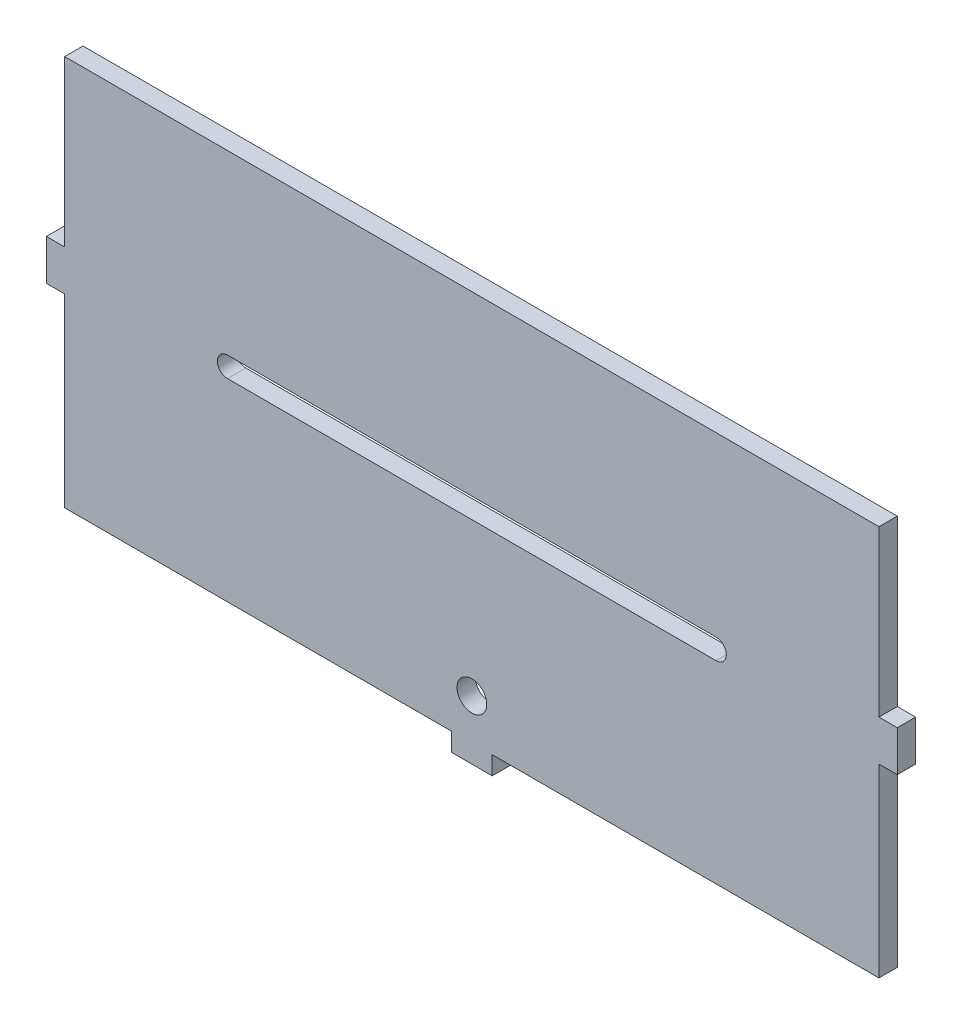
ISO-10303-21;
HEADER;
FILE_DESCRIPTION(('STEP AP214'),'2;1');
FILE_NAME('part.step','',(''),(''),'','','');
FILE_SCHEMA(('AUTOMOTIVE_DESIGN { 1 0 10303 214 1 1 1 1 }'));
ENDSEC;
DATA;
#1=APPLICATION_CONTEXT('core data for automotive mechanical design processes');
#2=APPLICATION_PROTOCOL_DEFINITION('international standard','automotive_design',2000,#1);
#3=PRODUCT_CONTEXT('',#1,'mechanical');
#4=PRODUCT('Part','Part','',(#3));
#5=PRODUCT_RELATED_PRODUCT_CATEGORY('part','',(#4));
#6=PRODUCT_DEFINITION_FORMATION('','',#4);
#7=PRODUCT_DEFINITION_CONTEXT('part definition',#1,'design');
#8=PRODUCT_DEFINITION('design','',#6,#7);
#9=PRODUCT_DEFINITION_SHAPE('','',#8);
#10=(LENGTH_UNIT() NAMED_UNIT(*) SI_UNIT(.MILLI.,.METRE.));
#11=(NAMED_UNIT(*) PLANE_ANGLE_UNIT() SI_UNIT($,.RADIAN.));
#12=(NAMED_UNIT(*) SI_UNIT($,.STERADIAN.) SOLID_ANGLE_UNIT());
#13=UNCERTAINTY_MEASURE_WITH_UNIT(LENGTH_MEASURE(1.E-05),#10,'distance_accuracy_value','');
#14=(GEOMETRIC_REPRESENTATION_CONTEXT(3) GLOBAL_UNCERTAINTY_ASSIGNED_CONTEXT((#13)) GLOBAL_UNIT_ASSIGNED_CONTEXT((#10,
#11,#12)) REPRESENTATION_CONTEXT('',''));
#15=CARTESIAN_POINT('',(0.,0.,0.));
#16=DIRECTION('',(0.,0.,1.));
#17=DIRECTION('',(1.,0.,0.));
#18=AXIS2_PLACEMENT_3D('',#15,#16,#17);
#19=CARTESIAN_POINT('',(127.,6.98499999999998,5.715));
#20=DIRECTION('',(-1.,0.,0.));
#21=DIRECTION('',(0.,0.,1.));
#22=AXIS2_PLACEMENT_3D('',#19,#20,#21);
#23=PLANE('',#22);
#24=DIRECTION('',(0.,1.,0.));
#25=VECTOR('',#24,1.);
#26=CARTESIAN_POINT('',(127.,6.98499999999998,0.));
#27=LINE('',#26,#25);
#28=CARTESIAN_POINT('',(127.,6.98499999999998,0.));
#29=VERTEX_POINT('',#28);
#30=CARTESIAN_POINT('',(127.,58.42,0.));
#31=VERTEX_POINT('',#30);
#32=EDGE_CURVE('E205',#29,#31,#27,.T.);
#33=ORIENTED_EDGE('',*,*,#32,.T.);
#34=DIRECTION('',(0.,0.,1.));
#35=VECTOR('',#34,1.);
#36=CARTESIAN_POINT('',(127.,58.42,0.));
#37=LINE('',#36,#35);
#38=CARTESIAN_POINT('',(127.,58.42,5.715));
#39=VERTEX_POINT('',#38);
#40=EDGE_CURVE('E60',#31,#39,#37,.T.);
#41=ORIENTED_EDGE('',*,*,#40,.T.);
#42=DIRECTION('',(0.,1.,0.));
#43=VECTOR('',#42,1.);
#44=CARTESIAN_POINT('',(127.,6.98499999999998,5.715));
#45=LINE('',#44,#43);
#46=CARTESIAN_POINT('',(127.,6.98499999999998,5.715));
#47=VERTEX_POINT('',#46);
#48=EDGE_CURVE('E252',#47,#39,#45,.T.);
#49=ORIENTED_EDGE('',*,*,#48,.F.);
#50=DIRECTION('',(0.,0.,-1.));
#51=VECTOR('',#50,1.);
#52=CARTESIAN_POINT('',(127.,6.98499999999998,5.715));
#53=LINE('',#52,#51);
#54=EDGE_CURVE('E253',#47,#29,#53,.T.);
#55=ORIENTED_EDGE('',*,*,#54,.T.);
#56=EDGE_LOOP('',(#33,#41,#49,#55));
#57=FACE_BOUND('',#56,.T.);
#58=ADVANCED_FACE('F45',(#57),#23,.F.);
#59=CARTESIAN_POINT('',(-127.,6.98499999999998,5.715));
#60=DIRECTION('',(1.,0.,0.));
#61=DIRECTION('',(0.,0.,-1.));
#62=AXIS2_PLACEMENT_3D('',#59,#60,#61);
#63=PLANE('',#62);
#64=DIRECTION('',(0.,-1.,0.));
#65=VECTOR('',#64,1.);
#66=CARTESIAN_POINT('',(-127.,6.98499999999998,5.715));
#67=LINE('',#66,#65);
#68=CARTESIAN_POINT('',(-127.,58.42,5.715));
#69=VERTEX_POINT('',#68);
#70=CARTESIAN_POINT('',(-127.,6.98499999999998,5.715));
#71=VERTEX_POINT('',#70);
#72=EDGE_CURVE('E196',#69,#71,#67,.T.);
#73=ORIENTED_EDGE('',*,*,#72,.F.);
#74=DIRECTION('',(0.,0.,1.));
#75=VECTOR('',#74,1.);
#76=CARTESIAN_POINT('',(-127.,58.42,0.));
#77=LINE('',#76,#75);
#78=CARTESIAN_POINT('',(-127.,58.42,0.));
#79=VERTEX_POINT('',#78);
#80=EDGE_CURVE('E182',#79,#69,#77,.T.);
#81=ORIENTED_EDGE('',*,*,#80,.F.);
#82=DIRECTION('',(0.,-1.,0.));
#83=VECTOR('',#82,1.);
#84=CARTESIAN_POINT('',(-127.,6.98499999999998,0.));
#85=LINE('',#84,#83);
#86=CARTESIAN_POINT('',(-127.,6.98499999999998,0.));
#87=VERTEX_POINT('',#86);
#88=EDGE_CURVE('E195',#79,#87,#85,.T.);
#89=ORIENTED_EDGE('',*,*,#88,.T.);
#90=DIRECTION('',(0.,0.,-1.));
#91=VECTOR('',#90,1.);
#92=CARTESIAN_POINT('',(-127.,6.98499999999998,5.715));
#93=LINE('',#92,#91);
#94=EDGE_CURVE('E11',#71,#87,#93,.T.);
#95=ORIENTED_EDGE('',*,*,#94,.F.);
#96=EDGE_LOOP('',(#73,#81,#89,#95));
#97=FACE_BOUND('',#96,.T.);
#98=ADVANCED_FACE('F193',(#97),#63,.F.);
#99=CARTESIAN_POINT('',(-132.715,6.98499999999998,5.715));
#100=DIRECTION('',(0.,-1.,0.));
#101=DIRECTION('',(0.,0.,-1.));
#102=AXIS2_PLACEMENT_3D('',#99,#100,#101);
#103=PLANE('',#102);
#104=DIRECTION('',(-1.,0.,0.));
#105=VECTOR('',#104,1.);
#106=CARTESIAN_POINT('',(-132.715,6.98499999999998,0.));
#107=LINE('',#106,#105);
#108=CARTESIAN_POINT('',(-132.715,6.98499999999998,0.));
#109=VERTEX_POINT('',#108);
#110=EDGE_CURVE('E203',#87,#109,#107,.T.);
#111=ORIENTED_EDGE('',*,*,#110,.T.);
#112=DIRECTION('',(0.,0.,-1.));
#113=VECTOR('',#112,1.);
#114=CARTESIAN_POINT('',(-132.715,6.98499999999998,5.715));
#115=LINE('',#114,#113);
#116=CARTESIAN_POINT('',(-132.715,6.98499999999998,5.715));
#117=VERTEX_POINT('',#116);
#118=EDGE_CURVE('E53',#117,#109,#115,.T.);
#119=ORIENTED_EDGE('',*,*,#118,.F.);
#120=DIRECTION('',(-1.,0.,0.));
#121=VECTOR('',#120,1.);
#122=CARTESIAN_POINT('',(-132.715,6.98499999999998,5.715));
#123=LINE('',#122,#121);
#124=EDGE_CURVE('E378',#71,#117,#123,.T.);
#125=ORIENTED_EDGE('',*,*,#124,.F.);
#126=ORIENTED_EDGE('',*,*,#94,.T.);
#127=EDGE_LOOP('',(#111,#119,#125,#126));
#128=FACE_BOUND('',#127,.T.);
#129=ADVANCED_FACE('F388',(#128),#103,.F.);
#130=CARTESIAN_POINT('',(-132.715,-5.71500000000002,5.715));
#131=DIRECTION('',(1.,0.,0.));
#132=DIRECTION('',(0.,0.,-1.));
#133=AXIS2_PLACEMENT_3D('',#130,#131,#132);
#134=PLANE('',#133);
#135=DIRECTION('',(0.,-1.,0.));
#136=VECTOR('',#135,1.);
#137=CARTESIAN_POINT('',(-132.715,-5.71500000000002,0.));
#138=LINE('',#137,#136);
#139=CARTESIAN_POINT('',(-132.715,-5.71500000000002,0.));
#140=VERTEX_POINT('',#139);
#141=EDGE_CURVE('E211',#109,#140,#138,.T.);
#142=ORIENTED_EDGE('',*,*,#141,.T.);
#143=DIRECTION('',(0.,0.,-1.));
#144=VECTOR('',#143,1.);
#145=CARTESIAN_POINT('',(-132.715,-5.71500000000002,5.715));
#146=LINE('',#145,#144);
#147=CARTESIAN_POINT('',(-132.715,-5.71500000000002,5.715));
#148=VERTEX_POINT('',#147);
#149=EDGE_CURVE('E298',#148,#140,#146,.T.);
#150=ORIENTED_EDGE('',*,*,#149,.F.);
#151=DIRECTION('',(0.,-1.,0.));
#152=VECTOR('',#151,1.);
#153=CARTESIAN_POINT('',(-132.715,-5.71500000000002,5.715));
#154=LINE('',#153,#152);
#155=EDGE_CURVE('E310',#117,#148,#154,.T.);
#156=ORIENTED_EDGE('',*,*,#155,.F.);
#157=ORIENTED_EDGE('',*,*,#118,.T.);
#158=EDGE_LOOP('',(#142,#150,#156,#157));
#159=FACE_BOUND('',#158,.T.);
#160=ADVANCED_FACE('F308',(#159),#134,.F.);
#161=CARTESIAN_POINT('',(-132.715,-5.71500000000002,5.715));
#162=DIRECTION('',(0.,1.,0.));
#163=DIRECTION('',(0.,0.,1.));
#164=AXIS2_PLACEMENT_3D('',#161,#162,#163);
#165=PLANE('',#164);
#166=DIRECTION('',(1.,0.,0.));
#167=VECTOR('',#166,1.);
#168=CARTESIAN_POINT('',(-132.715,-5.71500000000002,0.));
#169=LINE('',#168,#167);
#170=CARTESIAN_POINT('',(-127.,-5.71500000000002,0.));
#171=VERTEX_POINT('',#170);
#172=EDGE_CURVE('E219',#140,#171,#169,.T.);
#173=ORIENTED_EDGE('',*,*,#172,.T.);
#174=DIRECTION('',(0.,0.,-1.));
#175=VECTOR('',#174,1.);
#176=CARTESIAN_POINT('',(-127.,-5.71500000000002,5.715));
#177=LINE('',#176,#175);
#178=CARTESIAN_POINT('',(-127.,-5.71500000000002,5.715));
#179=VERTEX_POINT('',#178);
#180=EDGE_CURVE('E294',#179,#171,#177,.T.);
#181=ORIENTED_EDGE('',*,*,#180,.F.);
#182=DIRECTION('',(1.,0.,0.));
#183=VECTOR('',#182,1.);
#184=CARTESIAN_POINT('',(-132.715,-5.71500000000002,5.715));
#185=LINE('',#184,#183);
#186=EDGE_CURVE('E329',#148,#179,#185,.T.);
#187=ORIENTED_EDGE('',*,*,#186,.F.);
#188=ORIENTED_EDGE('',*,*,#149,.T.);
#189=EDGE_LOOP('',(#173,#181,#187,#188));
#190=FACE_BOUND('',#189,.T.);
#191=ADVANCED_FACE('F318',(#190),#165,.F.);
#192=CARTESIAN_POINT('',(-127.,-63.5,5.715));
#193=DIRECTION('',(1.,0.,0.));
#194=DIRECTION('',(0.,0.,-1.));
#195=AXIS2_PLACEMENT_3D('',#192,#193,#194);
#196=PLANE('',#195);
#197=DIRECTION('',(0.,-1.,0.));
#198=VECTOR('',#197,1.);
#199=CARTESIAN_POINT('',(-127.,-63.5,0.));
#200=LINE('',#199,#198);
#201=CARTESIAN_POINT('',(-127.,-63.5,0.));
#202=VERTEX_POINT('',#201);
#203=EDGE_CURVE('E222',#171,#202,#200,.T.);
#204=ORIENTED_EDGE('',*,*,#203,.T.);
#205=DIRECTION('',(0.,0.,-1.));
#206=VECTOR('',#205,1.);
#207=CARTESIAN_POINT('',(-127.,-63.5,5.715));
#208=LINE('',#207,#206);
#209=CARTESIAN_POINT('',(-127.,-63.5,5.715));
#210=VERTEX_POINT('',#209);
#211=EDGE_CURVE('E290',#210,#202,#208,.T.);
#212=ORIENTED_EDGE('',*,*,#211,.F.);
#213=DIRECTION('',(0.,-1.,0.));
#214=VECTOR('',#213,1.);
#215=CARTESIAN_POINT('',(-127.,-63.5,5.715));
#216=LINE('',#215,#214);
#217=EDGE_CURVE('E324',#179,#210,#216,.T.);
#218=ORIENTED_EDGE('',*,*,#217,.F.);
#219=ORIENTED_EDGE('',*,*,#180,.T.);
#220=EDGE_LOOP('',(#204,#212,#218,#219));
#221=FACE_BOUND('',#220,.T.);
#222=ADVANCED_FACE('F322',(#221),#196,.F.);
#223=CARTESIAN_POINT('',(-127.,-63.5,5.715));
#224=DIRECTION('',(0.,1.,0.));
#225=DIRECTION('',(0.,0.,1.));
#226=AXIS2_PLACEMENT_3D('',#223,#224,#225);
#227=PLANE('',#226);
#228=DIRECTION('',(1.,0.,0.));
#229=VECTOR('',#228,1.);
#230=CARTESIAN_POINT('',(-127.,-63.5,0.));
#231=LINE('',#230,#229);
#232=CARTESIAN_POINT('',(-6.35,-63.5,0.));
#233=VERTEX_POINT('',#232);
#234=EDGE_CURVE('E225',#202,#233,#231,.T.);
#235=ORIENTED_EDGE('',*,*,#234,.T.);
#236=DIRECTION('',(0.,0.,-1.));
#237=VECTOR('',#236,1.);
#238=CARTESIAN_POINT('',(-6.35,-63.5,5.715));
#239=LINE('',#238,#237);
#240=CARTESIAN_POINT('',(-6.35,-63.5,5.715));
#241=VERTEX_POINT('',#240);
#242=EDGE_CURVE('E286',#241,#233,#239,.T.);
#243=ORIENTED_EDGE('',*,*,#242,.F.);
#244=DIRECTION('',(1.,0.,0.));
#245=VECTOR('',#244,1.);
#246=CARTESIAN_POINT('',(-127.,-63.5,5.715));
#247=LINE('',#246,#245);
#248=EDGE_CURVE('E328',#210,#241,#247,.T.);
#249=ORIENTED_EDGE('',*,*,#248,.F.);
#250=ORIENTED_EDGE('',*,*,#211,.T.);
#251=EDGE_LOOP('',(#235,#243,#249,#250));
#252=FACE_BOUND('',#251,.T.);
#253=ADVANCED_FACE('F560',(#252),#227,.F.);
#254=CARTESIAN_POINT('',(-6.35,-69.215,5.715));
#255=DIRECTION('',(1.,0.,0.));
#256=DIRECTION('',(0.,1.,0.));
#257=AXIS2_PLACEMENT_3D('',#254,#255,#256);
#258=PLANE('',#257);
#259=DIRECTION('',(0.,-1.,0.));
#260=VECTOR('',#259,1.);
#261=CARTESIAN_POINT('',(-6.35,-69.215,0.));
#262=LINE('',#261,#260);
#263=CARTESIAN_POINT('',(-6.35,-69.215,0.));
#264=VERTEX_POINT('',#263);
#265=EDGE_CURVE('E228',#233,#264,#262,.T.);
#266=ORIENTED_EDGE('',*,*,#265,.T.);
#267=DIRECTION('',(0.,0.,-1.));
#268=VECTOR('',#267,1.);
#269=CARTESIAN_POINT('',(-6.35,-69.215,5.715));
#270=LINE('',#269,#268);
#271=CARTESIAN_POINT('',(-6.35,-69.215,5.715));
#272=VERTEX_POINT('',#271);
#273=EDGE_CURVE('E282',#272,#264,#270,.T.);
#274=ORIENTED_EDGE('',*,*,#273,.F.);
#275=DIRECTION('',(0.,-1.,0.));
#276=VECTOR('',#275,1.);
#277=CARTESIAN_POINT('',(-6.35,-69.215,5.715));
#278=LINE('',#277,#276);
#279=EDGE_CURVE('E335',#241,#272,#278,.T.);
#280=ORIENTED_EDGE('',*,*,#279,.F.);
#281=ORIENTED_EDGE('',*,*,#242,.T.);
#282=EDGE_LOOP('',(#266,#274,#280,#281));
#283=FACE_BOUND('',#282,.T.);
#284=ADVANCED_FACE('F549',(#283),#258,.F.);
#285=CARTESIAN_POINT('',(-6.35,-69.215,5.715));
#286=DIRECTION('',(0.,1.,0.));
#287=DIRECTION('',(0.,0.,1.));
#288=AXIS2_PLACEMENT_3D('',#285,#286,#287);
#289=PLANE('',#288);
#290=DIRECTION('',(1.,0.,0.));
#291=VECTOR('',#290,1.);
#292=CARTESIAN_POINT('',(-6.35,-69.215,0.));
#293=LINE('',#292,#291);
#294=CARTESIAN_POINT('',(6.35,-69.215,0.));
#295=VERTEX_POINT('',#294);
#296=EDGE_CURVE('E231',#264,#295,#293,.T.);
#297=ORIENTED_EDGE('',*,*,#296,.T.);
#298=DIRECTION('',(0.,0.,-1.));
#299=VECTOR('',#298,1.);
#300=CARTESIAN_POINT('',(6.35,-69.215,5.715));
#301=LINE('',#300,#299);
#302=CARTESIAN_POINT('',(6.35,-69.215,5.715));
#303=VERTEX_POINT('',#302);
#304=EDGE_CURVE('E278',#303,#295,#301,.T.);
#305=ORIENTED_EDGE('',*,*,#304,.F.);
#306=DIRECTION('',(1.,0.,0.));
#307=VECTOR('',#306,1.);
#308=CARTESIAN_POINT('',(-6.35,-69.215,5.715));
#309=LINE('',#308,#307);
#310=EDGE_CURVE('E342',#272,#303,#309,.T.);
#311=ORIENTED_EDGE('',*,*,#310,.F.);
#312=ORIENTED_EDGE('',*,*,#273,.T.);
#313=EDGE_LOOP('',(#297,#305,#311,#312));
#314=FACE_BOUND('',#313,.T.);
#315=ADVANCED_FACE('F538',(#314),#289,.F.);
#316=CARTESIAN_POINT('',(6.35,-69.215,5.715));
#317=DIRECTION('',(-1.,0.,0.));
#318=DIRECTION('',(0.,-1.,0.));
#319=AXIS2_PLACEMENT_3D('',#316,#317,#318);
#320=PLANE('',#319);
#321=DIRECTION('',(0.,1.,0.));
#322=VECTOR('',#321,1.);
#323=CARTESIAN_POINT('',(6.35,-69.215,0.));
#324=LINE('',#323,#322);
#325=CARTESIAN_POINT('',(6.35,-63.5,0.));
#326=VERTEX_POINT('',#325);
#327=EDGE_CURVE('E234',#295,#326,#324,.T.);
#328=ORIENTED_EDGE('',*,*,#327,.T.);
#329=DIRECTION('',(0.,0.,-1.));
#330=VECTOR('',#329,1.);
#331=CARTESIAN_POINT('',(6.35,-63.5,5.715));
#332=LINE('',#331,#330);
#333=CARTESIAN_POINT('',(6.35,-63.5,5.715));
#334=VERTEX_POINT('',#333);
#335=EDGE_CURVE('E274',#334,#326,#332,.T.);
#336=ORIENTED_EDGE('',*,*,#335,.F.);
#337=DIRECTION('',(0.,1.,0.));
#338=VECTOR('',#337,1.);
#339=CARTESIAN_POINT('',(6.35,-69.215,5.715));
#340=LINE('',#339,#338);
#341=EDGE_CURVE('E345',#303,#334,#340,.T.);
#342=ORIENTED_EDGE('',*,*,#341,.F.);
#343=ORIENTED_EDGE('',*,*,#304,.T.);
#344=EDGE_LOOP('',(#328,#336,#342,#343));
#345=FACE_BOUND('',#344,.T.);
#346=ADVANCED_FACE('F527',(#345),#320,.F.);
#347=CARTESIAN_POINT('',(6.35,-63.5,5.715));
#348=DIRECTION('',(0.,1.,0.));
#349=DIRECTION('',(0.,0.,1.));
#350=AXIS2_PLACEMENT_3D('',#347,#348,#349);
#351=PLANE('',#350);
#352=DIRECTION('',(1.,0.,0.));
#353=VECTOR('',#352,1.);
#354=CARTESIAN_POINT('',(6.35,-63.5,0.));
#355=LINE('',#354,#353);
#356=CARTESIAN_POINT('',(127.,-63.5,0.));
#357=VERTEX_POINT('',#356);
#358=EDGE_CURVE('E237',#326,#357,#355,.T.);
#359=ORIENTED_EDGE('',*,*,#358,.T.);
#360=DIRECTION('',(0.,0.,-1.));
#361=VECTOR('',#360,1.);
#362=CARTESIAN_POINT('',(127.,-63.5,5.715));
#363=LINE('',#362,#361);
#364=CARTESIAN_POINT('',(127.,-63.5,5.715));
#365=VERTEX_POINT('',#364);
#366=EDGE_CURVE('E270',#365,#357,#363,.T.);
#367=ORIENTED_EDGE('',*,*,#366,.F.);
#368=DIRECTION('',(1.,0.,0.));
#369=VECTOR('',#368,1.);
#370=CARTESIAN_POINT('',(6.35,-63.5,5.715));
#371=LINE('',#370,#369);
#372=EDGE_CURVE('E348',#334,#365,#371,.T.);
#373=ORIENTED_EDGE('',*,*,#372,.F.);
#374=ORIENTED_EDGE('',*,*,#335,.T.);
#375=EDGE_LOOP('',(#359,#367,#373,#374));
#376=FACE_BOUND('',#375,.T.);
#377=ADVANCED_FACE('F516',(#376),#351,.F.);
#378=CARTESIAN_POINT('',(127.,-63.5,5.715));
#379=DIRECTION('',(-1.,0.,0.));
#380=DIRECTION('',(0.,0.,1.));
#381=AXIS2_PLACEMENT_3D('',#378,#379,#380);
#382=PLANE('',#381);
#383=DIRECTION('',(0.,1.,0.));
#384=VECTOR('',#383,1.);
#385=CARTESIAN_POINT('',(127.,-63.5,0.));
#386=LINE('',#385,#384);
#387=CARTESIAN_POINT('',(127.,-5.71500000000002,0.));
#388=VERTEX_POINT('',#387);
#389=EDGE_CURVE('E240',#357,#388,#386,.T.);
#390=ORIENTED_EDGE('',*,*,#389,.T.);
#391=DIRECTION('',(0.,0.,-1.));
#392=VECTOR('',#391,1.);
#393=CARTESIAN_POINT('',(127.,-5.71500000000002,5.715));
#394=LINE('',#393,#392);
#395=CARTESIAN_POINT('',(127.,-5.71500000000002,5.715));
#396=VERTEX_POINT('',#395);
#397=EDGE_CURVE('E266',#396,#388,#394,.T.);
#398=ORIENTED_EDGE('',*,*,#397,.F.);
#399=DIRECTION('',(0.,1.,0.));
#400=VECTOR('',#399,1.);
#401=CARTESIAN_POINT('',(127.,-63.5,5.715));
#402=LINE('',#401,#400);
#403=EDGE_CURVE('E351',#365,#396,#402,.T.);
#404=ORIENTED_EDGE('',*,*,#403,.F.);
#405=ORIENTED_EDGE('',*,*,#366,.T.);
#406=EDGE_LOOP('',(#390,#398,#404,#405));
#407=FACE_BOUND('',#406,.T.);
#408=ADVANCED_FACE('F505',(#407),#382,.F.);
#409=CARTESIAN_POINT('',(132.715,-5.71500000000002,5.715));
#410=DIRECTION('',(0.,1.,0.));
#411=DIRECTION('',(0.,0.,1.));
#412=AXIS2_PLACEMENT_3D('',#409,#410,#411);
#413=PLANE('',#412);
#414=DIRECTION('',(1.,0.,0.));
#415=VECTOR('',#414,1.);
#416=CARTESIAN_POINT('',(132.715,-5.71500000000002,0.));
#417=LINE('',#416,#415);
#418=CARTESIAN_POINT('',(132.715,-5.71500000000002,0.));
#419=VERTEX_POINT('',#418);
#420=EDGE_CURVE('E243',#388,#419,#417,.T.);
#421=ORIENTED_EDGE('',*,*,#420,.T.);
#422=DIRECTION('',(0.,0.,-1.));
#423=VECTOR('',#422,1.);
#424=CARTESIAN_POINT('',(132.715,-5.71500000000002,5.715));
#425=LINE('',#424,#423);
#426=CARTESIAN_POINT('',(132.715,-5.71500000000002,5.715));
#427=VERTEX_POINT('',#426);
#428=EDGE_CURVE('E262',#427,#419,#425,.T.);
#429=ORIENTED_EDGE('',*,*,#428,.F.);
#430=DIRECTION('',(1.,0.,0.));
#431=VECTOR('',#430,1.);
#432=CARTESIAN_POINT('',(132.715,-5.71500000000002,5.715));
#433=LINE('',#432,#431);
#434=EDGE_CURVE('E354',#396,#427,#433,.T.);
#435=ORIENTED_EDGE('',*,*,#434,.F.);
#436=ORIENTED_EDGE('',*,*,#397,.T.);
#437=EDGE_LOOP('',(#421,#429,#435,#436));
#438=FACE_BOUND('',#437,.T.);
#439=ADVANCED_FACE('F494',(#438),#413,.F.);
#440=CARTESIAN_POINT('',(132.715,-5.71500000000002,5.715));
#441=DIRECTION('',(-1.,0.,0.));
#442=DIRECTION('',(0.,0.,1.));
#443=AXIS2_PLACEMENT_3D('',#440,#441,#442);
#444=PLANE('',#443);
#445=DIRECTION('',(0.,1.,0.));
#446=VECTOR('',#445,1.);
#447=CARTESIAN_POINT('',(132.715,-5.71500000000002,0.));
#448=LINE('',#447,#446);
#449=CARTESIAN_POINT('',(132.715,6.98499999999998,0.));
#450=VERTEX_POINT('',#449);
#451=EDGE_CURVE('E246',#419,#450,#448,.T.);
#452=ORIENTED_EDGE('',*,*,#451,.T.);
#453=DIRECTION('',(0.,0.,-1.));
#454=VECTOR('',#453,1.);
#455=CARTESIAN_POINT('',(132.715,6.98499999999998,5.715));
#456=LINE('',#455,#454);
#457=CARTESIAN_POINT('',(132.715,6.98499999999998,5.715));
#458=VERTEX_POINT('',#457);
#459=EDGE_CURVE('E257',#458,#450,#456,.T.);
#460=ORIENTED_EDGE('',*,*,#459,.F.);
#461=DIRECTION('',(0.,1.,0.));
#462=VECTOR('',#461,1.);
#463=CARTESIAN_POINT('',(132.715,-5.71500000000002,5.715));
#464=LINE('',#463,#462);
#465=EDGE_CURVE('E357',#427,#458,#464,.T.);
#466=ORIENTED_EDGE('',*,*,#465,.F.);
#467=ORIENTED_EDGE('',*,*,#428,.T.);
#468=EDGE_LOOP('',(#452,#460,#466,#467));
#469=FACE_BOUND('',#468,.T.);
#470=ADVANCED_FACE('F484',(#469),#444,.F.);
#471=CARTESIAN_POINT('',(132.715,6.98499999999998,5.715));
#472=DIRECTION('',(0.,-1.,0.));
#473=DIRECTION('',(0.,0.,-1.));
#474=AXIS2_PLACEMENT_3D('',#471,#472,#473);
#475=PLANE('',#474);
#476=DIRECTION('',(-1.,0.,0.));
#477=VECTOR('',#476,1.);
#478=CARTESIAN_POINT('',(132.715,6.98499999999998,0.));
#479=LINE('',#478,#477);
#480=EDGE_CURVE('E249',#450,#29,#479,.T.);
#481=ORIENTED_EDGE('',*,*,#480,.T.);
#482=ORIENTED_EDGE('',*,*,#54,.F.);
#483=DIRECTION('',(-1.,0.,0.));
#484=VECTOR('',#483,1.);
#485=CARTESIAN_POINT('',(132.715,6.98499999999998,5.715));
#486=LINE('',#485,#484);
#487=EDGE_CURVE('E258',#458,#47,#486,.T.);
#488=ORIENTED_EDGE('',*,*,#487,.F.);
#489=ORIENTED_EDGE('',*,*,#459,.T.);
#490=EDGE_LOOP('',(#481,#482,#488,#489));
#491=FACE_BOUND('',#490,.T.);
#492=ADVANCED_FACE('F370',(#491),#475,.F.);
#493=CARTESIAN_POINT('',(0.,0.,5.715));
#494=DIRECTION('',(0.,0.,-1.));
#495=DIRECTION('',(-1.,0.,0.));
#496=AXIS2_PLACEMENT_3D('',#493,#494,#495);
#497=PLANE('',#496);
#498=CARTESIAN_POINT('',(0.,-50.8,5.715));
#499=DIRECTION('',(0.,0.,1.));
#500=DIRECTION('',(1.,0.,0.));
#501=AXIS2_PLACEMENT_3D('',#498,#499,#500);
#502=CIRCLE('',#501,4.6355);
#503=CARTESIAN_POINT('',(4.6355,-50.8,5.715));
#504=VERTEX_POINT('',#503);
#505=EDGE_CURVE('E688',#504,#504,#502,.T.);
#506=ORIENTED_EDGE('',*,*,#505,.F.);
#507=EDGE_LOOP('',(#506));
#508=FACE_BOUND('',#507,.T.);
#509=DIRECTION('',(-1.,0.,0.));
#510=VECTOR('',#509,1.);
#511=CARTESIAN_POINT('',(76.2,3.17500000000003,5.715));
#512=LINE('',#511,#510);
#513=CARTESIAN_POINT('',(76.2,3.17500000000003,5.715));
#514=VERTEX_POINT('',#513);
#515=CARTESIAN_POINT('',(-76.2,3.17499999999998,5.715));
#516=VERTEX_POINT('',#515);
#517=EDGE_CURVE('E678',#514,#516,#512,.T.);
#518=ORIENTED_EDGE('',*,*,#517,.F.);
#519=CARTESIAN_POINT('',(76.2,0.,5.715));
#520=DIRECTION('',(0.,0.,1.));
#521=DIRECTION('',(1.,0.,0.));
#522=AXIS2_PLACEMENT_3D('',#519,#520,#521);
#523=CIRCLE('',#522,3.175);
#524=CARTESIAN_POINT('',(76.2,-3.17499999999997,5.715));
#525=VERTEX_POINT('',#524);
#526=EDGE_CURVE('E68',#525,#514,#523,.T.);
#527=ORIENTED_EDGE('',*,*,#526,.F.);
#528=DIRECTION('',(1.,0.,0.));
#529=VECTOR('',#528,1.);
#530=CARTESIAN_POINT('',(76.2,-3.17499999999997,5.715));
#531=LINE('',#530,#529);
#532=CARTESIAN_POINT('',(-76.2,-3.17500000000002,5.715));
#533=VERTEX_POINT('',#532);
#534=EDGE_CURVE('E665',#533,#525,#531,.T.);
#535=ORIENTED_EDGE('',*,*,#534,.F.);
#536=CARTESIAN_POINT('',(-76.2,0.,5.715));
#537=DIRECTION('',(0.,0.,1.));
#538=DIRECTION('',(1.,0.,0.));
#539=AXIS2_PLACEMENT_3D('',#536,#537,#538);
#540=CIRCLE('',#539,3.175);
#541=EDGE_CURVE('E674',#516,#533,#540,.T.);
#542=ORIENTED_EDGE('',*,*,#541,.F.);
#543=EDGE_LOOP('',(#518,#527,#535,#542));
#544=FACE_BOUND('',#543,.T.);
#545=ORIENTED_EDGE('',*,*,#48,.T.);
#546=DIRECTION('',(1.,0.,0.));
#547=VECTOR('',#546,1.);
#548=CARTESIAN_POINT('',(-127.,58.42,5.715));
#549=LINE('',#548,#547);
#550=EDGE_CURVE('E189',#69,#39,#549,.T.);
#551=ORIENTED_EDGE('',*,*,#550,.F.);
#552=ORIENTED_EDGE('',*,*,#72,.T.);
#553=ORIENTED_EDGE('',*,*,#124,.T.);
#554=ORIENTED_EDGE('',*,*,#155,.T.);
#555=ORIENTED_EDGE('',*,*,#186,.T.);
#556=ORIENTED_EDGE('',*,*,#217,.T.);
#557=ORIENTED_EDGE('',*,*,#248,.T.);
#558=ORIENTED_EDGE('',*,*,#279,.T.);
#559=ORIENTED_EDGE('',*,*,#310,.T.);
#560=ORIENTED_EDGE('',*,*,#341,.T.);
#561=ORIENTED_EDGE('',*,*,#372,.T.);
#562=ORIENTED_EDGE('',*,*,#403,.T.);
#563=ORIENTED_EDGE('',*,*,#434,.T.);
#564=ORIENTED_EDGE('',*,*,#465,.T.);
#565=ORIENTED_EDGE('',*,*,#487,.T.);
#566=EDGE_LOOP('',(#545,#551,#552,#553,#554,#555,#556,#557,#558,#559,#560,#561,#562,#563,#564,#565));
#567=FACE_BOUND('',#566,.T.);
#568=ADVANCED_FACE('F365',(#508,#544,#567),#497,.F.);
#569=CARTESIAN_POINT('',(0.,0.,0.));
#570=DIRECTION('',(0.,0.,-1.));
#571=DIRECTION('',(-1.,0.,0.));
#572=AXIS2_PLACEMENT_3D('',#569,#570,#571);
#573=PLANE('',#572);
#574=DIRECTION('',(1.,0.,0.));
#575=VECTOR('',#574,1.);
#576=CARTESIAN_POINT('',(-127.,58.42,0.));
#577=LINE('',#576,#575);
#578=EDGE_CURVE('E179',#79,#31,#577,.T.);
#579=ORIENTED_EDGE('',*,*,#578,.T.);
#580=ORIENTED_EDGE('',*,*,#32,.F.);
#581=ORIENTED_EDGE('',*,*,#480,.F.);
#582=ORIENTED_EDGE('',*,*,#451,.F.);
#583=ORIENTED_EDGE('',*,*,#420,.F.);
#584=ORIENTED_EDGE('',*,*,#389,.F.);
#585=ORIENTED_EDGE('',*,*,#358,.F.);
#586=ORIENTED_EDGE('',*,*,#327,.F.);
#587=ORIENTED_EDGE('',*,*,#296,.F.);
#588=ORIENTED_EDGE('',*,*,#265,.F.);
#589=ORIENTED_EDGE('',*,*,#234,.F.);
#590=ORIENTED_EDGE('',*,*,#203,.F.);
#591=ORIENTED_EDGE('',*,*,#172,.F.);
#592=ORIENTED_EDGE('',*,*,#141,.F.);
#593=ORIENTED_EDGE('',*,*,#110,.F.);
#594=ORIENTED_EDGE('',*,*,#88,.F.);
#595=EDGE_LOOP('',(#579,#580,#581,#582,#583,#584,#585,#586,#587,#588,#589,#590,#591,#592,#593,#594));
#596=FACE_BOUND('',#595,.T.);
#597=CARTESIAN_POINT('',(0.,-50.8,0.));
#598=DIRECTION('',(0.,0.,1.));
#599=DIRECTION('',(1.,0.,0.));
#600=AXIS2_PLACEMENT_3D('',#597,#598,#599);
#601=CIRCLE('',#600,4.6355);
#602=CARTESIAN_POINT('',(4.6355,-50.8,0.));
#603=VERTEX_POINT('',#602);
#604=EDGE_CURVE('E680',#603,#603,#601,.T.);
#605=ORIENTED_EDGE('',*,*,#604,.T.);
#606=EDGE_LOOP('',(#605));
#607=FACE_BOUND('',#606,.T.);
#608=CARTESIAN_POINT('',(76.2,0.,0.));
#609=DIRECTION('',(0.,0.,1.));
#610=DIRECTION('',(1.,0.,0.));
#611=AXIS2_PLACEMENT_3D('',#608,#609,#610);
#612=CIRCLE('',#611,3.175);
#613=CARTESIAN_POINT('',(76.2,-3.17499999999997,0.));
#614=VERTEX_POINT('',#613);
#615=CARTESIAN_POINT('',(76.2,3.17500000000003,0.));
#616=VERTEX_POINT('',#615);
#617=EDGE_CURVE('E673',#614,#616,#612,.T.);
#618=ORIENTED_EDGE('',*,*,#617,.T.);
#619=DIRECTION('',(-1.,0.,0.));
#620=VECTOR('',#619,1.);
#621=CARTESIAN_POINT('',(76.2,3.17500000000003,0.));
#622=LINE('',#621,#620);
#623=CARTESIAN_POINT('',(-76.2,3.17499999999998,0.));
#624=VERTEX_POINT('',#623);
#625=EDGE_CURVE('E717',#616,#624,#622,.T.);
#626=ORIENTED_EDGE('',*,*,#625,.T.);
#627=CARTESIAN_POINT('',(-76.2,0.,0.));
#628=DIRECTION('',(0.,0.,1.));
#629=DIRECTION('',(1.,0.,0.));
#630=AXIS2_PLACEMENT_3D('',#627,#628,#629);
#631=CIRCLE('',#630,3.175);
#632=CARTESIAN_POINT('',(-76.2,-3.17500000000002,0.));
#633=VERTEX_POINT('',#632);
#634=EDGE_CURVE('E710',#624,#633,#631,.T.);
#635=ORIENTED_EDGE('',*,*,#634,.T.);
#636=DIRECTION('',(1.,0.,0.));
#637=VECTOR('',#636,1.);
#638=CARTESIAN_POINT('',(76.2,-3.17499999999997,0.));
#639=LINE('',#638,#637);
#640=EDGE_CURVE('E691',#633,#614,#639,.T.);
#641=ORIENTED_EDGE('',*,*,#640,.T.);
#642=EDGE_LOOP('',(#618,#626,#635,#641));
#643=FACE_BOUND('',#642,.T.);
#644=ADVANCED_FACE('F200',(#596,#607,#643),#573,.T.);
#645=CARTESIAN_POINT('',(76.2,0.,0.));
#646=DIRECTION('',(0.,0.,1.));
#647=DIRECTION('',(1.,0.,0.));
#648=AXIS2_PLACEMENT_3D('',#645,#646,#647);
#649=CYLINDRICAL_SURFACE('',#648,3.175);
#650=ORIENTED_EDGE('',*,*,#526,.T.);
#651=DIRECTION('',(0.,0.,1.));
#652=VECTOR('',#651,1.);
#653=CARTESIAN_POINT('',(76.2,3.17500000000003,0.));
#654=LINE('',#653,#652);
#655=EDGE_CURVE('E381',#616,#514,#654,.T.);
#656=ORIENTED_EDGE('',*,*,#655,.F.);
#657=ORIENTED_EDGE('',*,*,#617,.F.);
#658=DIRECTION('',(0.,0.,1.));
#659=VECTOR('',#658,1.);
#660=CARTESIAN_POINT('',(76.2,-3.17499999999997,0.));
#661=LINE('',#660,#659);
#662=EDGE_CURVE('E213',#614,#525,#661,.T.);
#663=ORIENTED_EDGE('',*,*,#662,.T.);
#664=EDGE_LOOP('',(#650,#656,#657,#663));
#665=FACE_BOUND('',#664,.T.);
#666=ADVANCED_FACE('F427',(#665),#649,.F.);
#667=CARTESIAN_POINT('',(76.2,-3.17499999999997,0.));
#668=DIRECTION('',(0.,-1.,0.));
#669=DIRECTION('',(1.,0.,0.));
#670=AXIS2_PLACEMENT_3D('',#667,#668,#669);
#671=PLANE('',#670);
#672=ORIENTED_EDGE('',*,*,#534,.T.);
#673=ORIENTED_EDGE('',*,*,#662,.F.);
#674=ORIENTED_EDGE('',*,*,#640,.F.);
#675=DIRECTION('',(0.,0.,1.));
#676=VECTOR('',#675,1.);
#677=CARTESIAN_POINT('',(-76.2,-3.17500000000002,0.));
#678=LINE('',#677,#676);
#679=EDGE_CURVE('E668',#633,#533,#678,.T.);
#680=ORIENTED_EDGE('',*,*,#679,.T.);
#681=EDGE_LOOP('',(#672,#673,#674,#680));
#682=FACE_BOUND('',#681,.T.);
#683=ADVANCED_FACE('F463',(#682),#671,.F.);
#684=CARTESIAN_POINT('',(-76.2,0.,0.));
#685=DIRECTION('',(0.,0.,1.));
#686=DIRECTION('',(1.,0.,0.));
#687=AXIS2_PLACEMENT_3D('',#684,#685,#686);
#688=CYLINDRICAL_SURFACE('',#687,3.175);
#689=ORIENTED_EDGE('',*,*,#541,.T.);
#690=ORIENTED_EDGE('',*,*,#679,.F.);
#691=ORIENTED_EDGE('',*,*,#634,.F.);
#692=DIRECTION('',(0.,0.,1.));
#693=VECTOR('',#692,1.);
#694=CARTESIAN_POINT('',(-76.2,3.17499999999998,0.));
#695=LINE('',#694,#693);
#696=EDGE_CURVE('E699',#624,#516,#695,.T.);
#697=ORIENTED_EDGE('',*,*,#696,.T.);
#698=EDGE_LOOP('',(#689,#690,#691,#697));
#699=FACE_BOUND('',#698,.T.);
#700=ADVANCED_FACE('F455',(#699),#688,.F.);
#701=CARTESIAN_POINT('',(76.2,3.17500000000003,0.));
#702=DIRECTION('',(0.,1.,0.));
#703=DIRECTION('',(-1.,0.,0.));
#704=AXIS2_PLACEMENT_3D('',#701,#702,#703);
#705=PLANE('',#704);
#706=ORIENTED_EDGE('',*,*,#517,.T.);
#707=ORIENTED_EDGE('',*,*,#696,.F.);
#708=ORIENTED_EDGE('',*,*,#625,.F.);
#709=ORIENTED_EDGE('',*,*,#655,.T.);
#710=EDGE_LOOP('',(#706,#707,#708,#709));
#711=FACE_BOUND('',#710,.T.);
#712=ADVANCED_FACE('F448',(#711),#705,.F.);
#713=CARTESIAN_POINT('',(0.,-50.8,0.));
#714=DIRECTION('',(0.,0.,1.));
#715=DIRECTION('',(1.,0.,0.));
#716=AXIS2_PLACEMENT_3D('',#713,#714,#715);
#717=CYLINDRICAL_SURFACE('',#716,4.6355);
#718=ORIENTED_EDGE('',*,*,#604,.F.);
#719=EDGE_LOOP('',(#718));
#720=FACE_BOUND('',#719,.T.);
#721=ORIENTED_EDGE('',*,*,#505,.T.);
#722=EDGE_LOOP('',(#721));
#723=FACE_BOUND('',#722,.T.);
#724=ADVANCED_FACE('F438',(#720,#723),#717,.F.);
#725=CARTESIAN_POINT('',(-127.,58.42,0.));
#726=DIRECTION('',(0.,-1.,0.));
#727=DIRECTION('',(0.,0.,-1.));
#728=AXIS2_PLACEMENT_3D('',#725,#726,#727);
#729=PLANE('',#728);
#730=ORIENTED_EDGE('',*,*,#550,.T.);
#731=ORIENTED_EDGE('',*,*,#40,.F.);
#732=ORIENTED_EDGE('',*,*,#578,.F.);
#733=ORIENTED_EDGE('',*,*,#80,.T.);
#734=EDGE_LOOP('',(#730,#731,#732,#733));
#735=FACE_BOUND('',#734,.T.);
#736=ADVANCED_FACE('F181',(#735),#729,.F.);
#737=CLOSED_SHELL('',(#58,#98,#129,#160,#191,#222,#253,#284,#315,#346,#377,#408,#439,#470,#492,
#568,#644,#666,#683,#700,#712,#724,#736));
#738=MANIFOLD_SOLID_BREP('B2',#737);
#739=ADVANCED_BREP_SHAPE_REPRESENTATION('',(#18,#738),#14);
#740=SHAPE_DEFINITION_REPRESENTATION(#9,#739);
ENDSEC;
END-ISO-10303-21;
